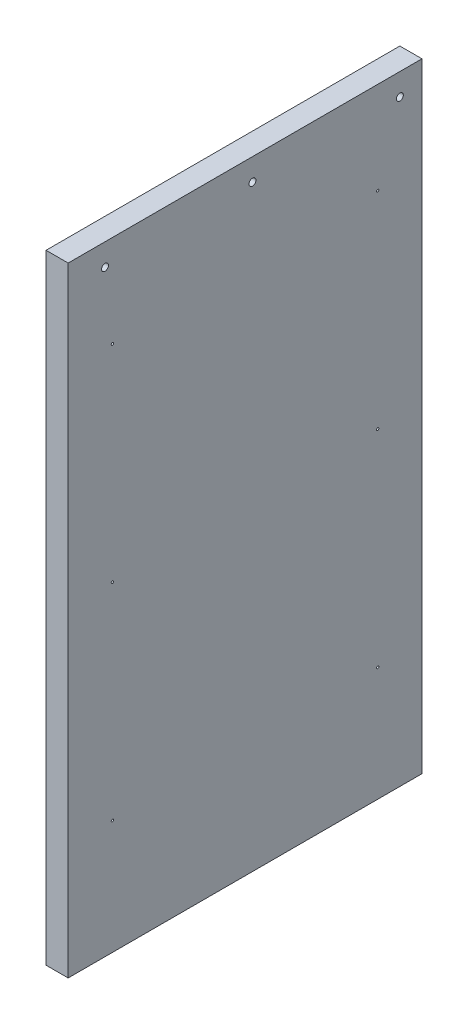
ISO-10303-21;
HEADER;
FILE_DESCRIPTION(('STEP AP214'),'2;1');
FILE_NAME('part.step','',(''),(''),'','','');
FILE_SCHEMA(('AUTOMOTIVE_DESIGN { 1 0 10303 214 1 1 1 1 }'));
ENDSEC;
DATA;
#1=APPLICATION_CONTEXT('core data for automotive mechanical design processes');
#2=APPLICATION_PROTOCOL_DEFINITION('international standard','automotive_design',2000,#1);
#3=PRODUCT_CONTEXT('',#1,'mechanical');
#4=PRODUCT('Part','Part','',(#3));
#5=PRODUCT_RELATED_PRODUCT_CATEGORY('part','',(#4));
#6=PRODUCT_DEFINITION_FORMATION('','',#4);
#7=PRODUCT_DEFINITION_CONTEXT('part definition',#1,'design');
#8=PRODUCT_DEFINITION('design','',#6,#7);
#9=PRODUCT_DEFINITION_SHAPE('','',#8);
#10=(LENGTH_UNIT() NAMED_UNIT(*) SI_UNIT(.MILLI.,.METRE.));
#11=(NAMED_UNIT(*) PLANE_ANGLE_UNIT() SI_UNIT($,.RADIAN.));
#12=(NAMED_UNIT(*) SI_UNIT($,.STERADIAN.) SOLID_ANGLE_UNIT());
#13=UNCERTAINTY_MEASURE_WITH_UNIT(LENGTH_MEASURE(1.E-05),#10,'distance_accuracy_value','');
#14=(GEOMETRIC_REPRESENTATION_CONTEXT(3) GLOBAL_UNCERTAINTY_ASSIGNED_CONTEXT((#13)) GLOBAL_UNIT_ASSIGNED_CONTEXT((#10,
#11,#12)) REPRESENTATION_CONTEXT('',''));
#15=CARTESIAN_POINT('',(0.,0.,0.));
#16=DIRECTION('',(0.,0.,1.));
#17=DIRECTION('',(1.,0.,0.));
#18=AXIS2_PLACEMENT_3D('',#15,#16,#17);
#19=CARTESIAN_POINT('',(-312.419999999999,2.66453525910038E-12,-4.44089209850063E-13));
#20=DIRECTION('',(-1.,0.,0.));
#21=DIRECTION('',(0.,0.,-1.));
#22=AXIS2_PLACEMENT_3D('',#19,#20,#21);
#23=PLANE('',#22);
#24=CARTESIAN_POINT('',(-312.42,5708.65,3032.76));
#25=DIRECTION('',(-1.,0.,0.));
#26=DIRECTION('',(0.,0.,1.));
#27=AXIS2_PLACEMENT_3D('',#24,#25,#26);
#28=CIRCLE('',#27,2.9766259999997);
#29=CARTESIAN_POINT('',(-312.42,5708.65,3035.736626));
#30=VERTEX_POINT('',#29);
#31=EDGE_CURVE('E322',#30,#30,#28,.T.);
#32=ORIENTED_EDGE('',*,*,#31,.F.);
#33=EDGE_LOOP('',(#32));
#34=FACE_BOUND('',#33,.T.);
#35=CARTESIAN_POINT('',(-312.419999999999,5708.65000000001,2905.76));
#36=DIRECTION('',(-1.,0.,0.));
#37=DIRECTION('',(0.,0.,1.));
#38=AXIS2_PLACEMENT_3D('',#35,#36,#37);
#39=CIRCLE('',#38,2.9766259999997);
#40=CARTESIAN_POINT('',(-312.419999999999,5708.65000000001,2908.736626));
#41=VERTEX_POINT('',#40);
#42=EDGE_CURVE('E332',#41,#41,#39,.T.);
#43=ORIENTED_EDGE('',*,*,#42,.F.);
#44=EDGE_LOOP('',(#43));
#45=FACE_BOUND('',#44,.T.);
#46=DIRECTION('',(0.,0.,-1.));
#47=VECTOR('',#46,1.);
#48=CARTESIAN_POINT('',(-312.42,5194.30000000001,3064.51));
#49=LINE('',#48,#47);
#50=CARTESIAN_POINT('',(-312.42,5194.30000000001,3064.51));
#51=VERTEX_POINT('',#50);
#52=CARTESIAN_POINT('',(-312.420000000001,5194.3,2759.71));
#53=VERTEX_POINT('',#52);
#54=EDGE_CURVE('E113',#51,#53,#49,.T.);
#55=ORIENTED_EDGE('',*,*,#54,.F.);
#56=DIRECTION('',(0.,-1.,0.));
#57=VECTOR('',#56,1.);
#58=CARTESIAN_POINT('',(-312.419999999999,5727.70000000001,3064.51));
#59=LINE('',#58,#57);
#60=CARTESIAN_POINT('',(-312.419999999999,5727.70000000001,3064.51));
#61=VERTEX_POINT('',#60);
#62=EDGE_CURVE('E117',#61,#51,#59,.T.);
#63=ORIENTED_EDGE('',*,*,#62,.F.);
#64=DIRECTION('',(0.,0.,1.));
#65=VECTOR('',#64,1.);
#66=CARTESIAN_POINT('',(-312.420000000001,5727.7,2759.71));
#67=LINE('',#66,#65);
#68=CARTESIAN_POINT('',(-312.420000000001,5727.7,2759.71));
#69=VERTEX_POINT('',#68);
#70=EDGE_CURVE('E112',#69,#61,#67,.T.);
#71=ORIENTED_EDGE('',*,*,#70,.F.);
#72=DIRECTION('',(0.,1.,0.));
#73=VECTOR('',#72,1.);
#74=CARTESIAN_POINT('',(-312.420000000001,5194.3,2759.71));
#75=LINE('',#74,#73);
#76=EDGE_CURVE('E107',#53,#69,#75,.T.);
#77=ORIENTED_EDGE('',*,*,#76,.F.);
#78=EDGE_LOOP('',(#55,#63,#71,#77));
#79=FACE_BOUND('',#78,.T.);
#80=CARTESIAN_POINT('',(-312.420000000001,5292.725,3026.41));
#81=DIRECTION('',(1.,0.,0.));
#82=DIRECTION('',(0.,0.,-1.));
#83=AXIS2_PLACEMENT_3D('',#80,#81,#82);
#84=CIRCLE('',#83,0.991870000000006);
#85=CARTESIAN_POINT('',(-312.420000000001,5292.725,3025.41813));
#86=VERTEX_POINT('',#85);
#87=EDGE_CURVE('E125',#86,#86,#84,.T.);
#88=ORIENTED_EDGE('',*,*,#87,.T.);
#89=EDGE_LOOP('',(#88));
#90=FACE_BOUND('',#89,.T.);
#91=CARTESIAN_POINT('',(-312.419999999999,5292.72500000001,2797.81));
#92=DIRECTION('',(1.,0.,0.));
#93=DIRECTION('',(0.,0.,-1.));
#94=AXIS2_PLACEMENT_3D('',#91,#92,#93);
#95=CIRCLE('',#94,0.991870000000006);
#96=CARTESIAN_POINT('',(-312.419999999999,5292.72500000001,2796.81813));
#97=VERTEX_POINT('',#96);
#98=EDGE_CURVE('E129',#97,#97,#95,.T.);
#99=ORIENTED_EDGE('',*,*,#98,.T.);
#100=EDGE_LOOP('',(#99));
#101=FACE_BOUND('',#100,.T.);
#102=CARTESIAN_POINT('',(-312.42,5470.52500000001,3026.41));
#103=DIRECTION('',(1.,0.,0.));
#104=DIRECTION('',(0.,0.,-1.));
#105=AXIS2_PLACEMENT_3D('',#102,#103,#104);
#106=CIRCLE('',#105,0.991870000000006);
#107=CARTESIAN_POINT('',(-312.42,5470.52500000001,3025.41813));
#108=VERTEX_POINT('',#107);
#109=EDGE_CURVE('E132',#108,#108,#106,.T.);
#110=ORIENTED_EDGE('',*,*,#109,.T.);
#111=EDGE_LOOP('',(#110));
#112=FACE_BOUND('',#111,.T.);
#113=CARTESIAN_POINT('',(-312.419999999998,5470.52500000001,2797.81));
#114=DIRECTION('',(1.,0.,0.));
#115=DIRECTION('',(0.,0.,-1.));
#116=AXIS2_PLACEMENT_3D('',#113,#114,#115);
#117=CIRCLE('',#116,0.991870000000006);
#118=CARTESIAN_POINT('',(-312.419999999998,5470.52500000001,2796.81813));
#119=VERTEX_POINT('',#118);
#120=EDGE_CURVE('E136',#119,#119,#117,.T.);
#121=ORIENTED_EDGE('',*,*,#120,.T.);
#122=EDGE_LOOP('',(#121));
#123=FACE_BOUND('',#122,.T.);
#124=CARTESIAN_POINT('',(-312.419999999999,5648.32500000001,2797.81));
#125=DIRECTION('',(1.,0.,0.));
#126=DIRECTION('',(0.,0.,-1.));
#127=AXIS2_PLACEMENT_3D('',#124,#125,#126);
#128=CIRCLE('',#127,0.991870000000006);
#129=CARTESIAN_POINT('',(-312.419999999999,5648.32500000001,2796.81813));
#130=VERTEX_POINT('',#129);
#131=EDGE_CURVE('E140',#130,#130,#128,.T.);
#132=ORIENTED_EDGE('',*,*,#131,.T.);
#133=EDGE_LOOP('',(#132));
#134=FACE_BOUND('',#133,.T.);
#135=CARTESIAN_POINT('',(-312.42,5648.325,3026.41));
#136=DIRECTION('',(1.,0.,0.));
#137=DIRECTION('',(0.,0.,-1.));
#138=AXIS2_PLACEMENT_3D('',#135,#136,#137);
#139=CIRCLE('',#138,0.991870000000006);
#140=CARTESIAN_POINT('',(-312.42,5648.325,3025.41813));
#141=VERTEX_POINT('',#140);
#142=EDGE_CURVE('E142',#141,#141,#139,.T.);
#143=ORIENTED_EDGE('',*,*,#142,.T.);
#144=EDGE_LOOP('',(#143));
#145=FACE_BOUND('',#144,.T.);
#146=CARTESIAN_POINT('',(-312.419999999999,5708.65000000001,2778.76));
#147=DIRECTION('',(-1.,0.,0.));
#148=DIRECTION('',(0.,0.,1.));
#149=AXIS2_PLACEMENT_3D('',#146,#147,#148);
#150=CIRCLE('',#149,2.9766259999997);
#151=CARTESIAN_POINT('',(-312.419999999999,5708.65000000001,2781.736626));
#152=VERTEX_POINT('',#151);
#153=EDGE_CURVE('E152',#152,#152,#150,.T.);
#154=ORIENTED_EDGE('',*,*,#153,.F.);
#155=EDGE_LOOP('',(#154));
#156=FACE_BOUND('',#155,.T.);
#157=ADVANCED_FACE('F49',(#34,#45,#79,#90,#101,#112,#123,#134,#145,#156),#23,.T.);
#158=CARTESIAN_POINT('',(-292.1,5727.70000000001,3064.51));
#159=DIRECTION('',(0.,0.,1.));
#160=DIRECTION('',(-1.,0.,0.));
#161=AXIS2_PLACEMENT_3D('',#158,#159,#160);
#162=PLANE('',#161);
#163=DIRECTION('',(-1.,0.,0.));
#164=VECTOR('',#163,1.);
#165=CARTESIAN_POINT('',(-292.1,5727.70000000001,3064.51));
#166=LINE('',#165,#164);
#167=CARTESIAN_POINT('',(-293.369999999999,5727.70000000001,3064.51));
#168=VERTEX_POINT('',#167);
#169=EDGE_CURVE('E58',#168,#61,#166,.T.);
#170=ORIENTED_EDGE('',*,*,#169,.T.);
#171=ORIENTED_EDGE('',*,*,#62,.T.);
#172=DIRECTION('',(-1.,0.,0.));
#173=VECTOR('',#172,1.);
#174=CARTESIAN_POINT('',(-292.099999999999,5194.30000000001,3064.51));
#175=LINE('',#174,#173);
#176=CARTESIAN_POINT('',(-293.369999999998,5194.30000000001,3064.51));
#177=VERTEX_POINT('',#176);
#178=EDGE_CURVE('E74',#51,#177,#175,.F.);
#179=ORIENTED_EDGE('',*,*,#178,.T.);
#180=DIRECTION('',(0.,1.,0.));
#181=VECTOR('',#180,1.);
#182=CARTESIAN_POINT('',(-293.369999999998,5194.30000000001,3064.51));
#183=LINE('',#182,#181);
#184=EDGE_CURVE('E165',#177,#168,#183,.T.);
#185=ORIENTED_EDGE('',*,*,#184,.T.);
#186=EDGE_LOOP('',(#170,#171,#179,#185));
#187=FACE_BOUND('',#186,.T.);
#188=ADVANCED_FACE('F51',(#187),#162,.T.);
#189=CARTESIAN_POINT('',(-292.099999999999,5194.30000000001,3064.51));
#190=DIRECTION('',(0.,-1.,0.));
#191=DIRECTION('',(0.,0.,-1.));
#192=AXIS2_PLACEMENT_3D('',#189,#190,#191);
#193=PLANE('',#192);
#194=ORIENTED_EDGE('',*,*,#178,.F.);
#195=ORIENTED_EDGE('',*,*,#54,.T.);
#196=DIRECTION('',(1.,0.,0.));
#197=VECTOR('',#196,1.);
#198=CARTESIAN_POINT('',(-292.100000000001,5194.3,2759.71));
#199=LINE('',#198,#197);
#200=CARTESIAN_POINT('',(-293.369999999999,5194.3,2759.71));
#201=VERTEX_POINT('',#200);
#202=EDGE_CURVE('E109',#53,#201,#199,.T.);
#203=ORIENTED_EDGE('',*,*,#202,.T.);
#204=DIRECTION('',(0.,0.,1.));
#205=VECTOR('',#204,1.);
#206=CARTESIAN_POINT('',(-293.369999999999,5194.3,2759.71));
#207=LINE('',#206,#205);
#208=EDGE_CURVE('E101',#201,#177,#207,.T.);
#209=ORIENTED_EDGE('',*,*,#208,.T.);
#210=EDGE_LOOP('',(#194,#195,#203,#209));
#211=FACE_BOUND('',#210,.T.);
#212=ADVANCED_FACE('F166',(#211),#193,.T.);
#213=CARTESIAN_POINT('',(-292.100000000001,5194.3,2759.71));
#214=DIRECTION('',(0.,0.,-1.));
#215=DIRECTION('',(1.,0.,0.));
#216=AXIS2_PLACEMENT_3D('',#213,#214,#215);
#217=PLANE('',#216);
#218=ORIENTED_EDGE('',*,*,#202,.F.);
#219=ORIENTED_EDGE('',*,*,#76,.T.);
#220=DIRECTION('',(-1.,0.,0.));
#221=VECTOR('',#220,1.);
#222=CARTESIAN_POINT('',(-292.1,5727.70000000001,2759.71));
#223=LINE('',#222,#221);
#224=CARTESIAN_POINT('',(-293.370000000001,5727.70000000001,2759.71));
#225=VERTEX_POINT('',#224);
#226=EDGE_CURVE('E13',#69,#225,#223,.F.);
#227=ORIENTED_EDGE('',*,*,#226,.T.);
#228=DIRECTION('',(0.,-1.,0.));
#229=VECTOR('',#228,1.);
#230=CARTESIAN_POINT('',(-293.370000000001,5727.70000000001,2759.71));
#231=LINE('',#230,#229);
#232=EDGE_CURVE('E96',#225,#201,#231,.T.);
#233=ORIENTED_EDGE('',*,*,#232,.T.);
#234=EDGE_LOOP('',(#218,#219,#227,#233));
#235=FACE_BOUND('',#234,.T.);
#236=ADVANCED_FACE('F105',(#235),#217,.T.);
#237=CARTESIAN_POINT('',(-292.1,5727.70000000001,2759.71));
#238=DIRECTION('',(0.,1.,0.));
#239=DIRECTION('',(0.,0.,1.));
#240=AXIS2_PLACEMENT_3D('',#237,#238,#239);
#241=PLANE('',#240);
#242=ORIENTED_EDGE('',*,*,#226,.F.);
#243=ORIENTED_EDGE('',*,*,#70,.T.);
#244=ORIENTED_EDGE('',*,*,#169,.F.);
#245=DIRECTION('',(0.,0.,-1.));
#246=VECTOR('',#245,1.);
#247=CARTESIAN_POINT('',(-293.369999999999,5727.70000000001,3064.51));
#248=LINE('',#247,#246);
#249=EDGE_CURVE('E66',#168,#225,#248,.T.);
#250=ORIENTED_EDGE('',*,*,#249,.T.);
#251=EDGE_LOOP('',(#242,#243,#244,#250));
#252=FACE_BOUND('',#251,.T.);
#253=ADVANCED_FACE('F93',(#252),#241,.T.);
#254=CARTESIAN_POINT('',(-293.370000000001,0.,-4.44089209850063E-13));
#255=DIRECTION('',(1.,0.,0.));
#256=DIRECTION('',(0.,-1.,0.));
#257=AXIS2_PLACEMENT_3D('',#254,#255,#256);
#258=PLANE('',#257);
#259=CARTESIAN_POINT('',(-293.370000000001,5708.65000000001,3032.76));
#260=DIRECTION('',(-1.,0.,0.));
#261=DIRECTION('',(0.,0.,1.));
#262=AXIS2_PLACEMENT_3D('',#259,#260,#261);
#263=CIRCLE('',#262,2.9766259999997);
#264=CARTESIAN_POINT('',(-293.370000000001,5708.65000000001,3035.736626));
#265=VERTEX_POINT('',#264);
#266=EDGE_CURVE('E325',#265,#265,#263,.T.);
#267=ORIENTED_EDGE('',*,*,#266,.T.);
#268=EDGE_LOOP('',(#267));
#269=FACE_BOUND('',#268,.T.);
#270=CARTESIAN_POINT('',(-293.369999999999,5708.65000000001,2905.76));
#271=DIRECTION('',(-1.,0.,0.));
#272=DIRECTION('',(0.,0.,1.));
#273=AXIS2_PLACEMENT_3D('',#270,#271,#272);
#274=CIRCLE('',#273,2.9766259999997);
#275=CARTESIAN_POINT('',(-293.369999999999,5708.65000000001,2908.736626));
#276=VERTEX_POINT('',#275);
#277=EDGE_CURVE('E327',#276,#276,#274,.T.);
#278=ORIENTED_EDGE('',*,*,#277,.T.);
#279=EDGE_LOOP('',(#278));
#280=FACE_BOUND('',#279,.T.);
#281=CARTESIAN_POINT('',(-293.369999999999,5708.65000000001,2778.76));
#282=DIRECTION('',(-1.,0.,0.));
#283=DIRECTION('',(0.,0.,1.));
#284=AXIS2_PLACEMENT_3D('',#281,#282,#283);
#285=CIRCLE('',#284,2.9766259999997);
#286=CARTESIAN_POINT('',(-293.369999999999,5708.65000000001,2781.736626));
#287=VERTEX_POINT('',#286);
#288=EDGE_CURVE('E334',#287,#287,#285,.T.);
#289=ORIENTED_EDGE('',*,*,#288,.T.);
#290=EDGE_LOOP('',(#289));
#291=FACE_BOUND('',#290,.T.);
#292=CARTESIAN_POINT('',(-293.37,5648.325,3026.41));
#293=DIRECTION('',(-1.,0.,0.));
#294=DIRECTION('',(0.,-1.,0.));
#295=AXIS2_PLACEMENT_3D('',#292,#293,#294);
#296=CIRCLE('',#295,0.991870000000006);
#297=CARTESIAN_POINT('',(-293.37,5647.33313,3026.41));
#298=VERTEX_POINT('',#297);
#299=EDGE_CURVE('E53',#298,#298,#296,.T.);
#300=ORIENTED_EDGE('',*,*,#299,.T.);
#301=EDGE_LOOP('',(#300));
#302=FACE_BOUND('',#301,.T.);
#303=CARTESIAN_POINT('',(-293.369999999999,5648.32500000001,2797.81));
#304=DIRECTION('',(-1.,0.,0.));
#305=DIRECTION('',(0.,-1.,0.));
#306=AXIS2_PLACEMENT_3D('',#303,#304,#305);
#307=CIRCLE('',#306,0.991870000000006);
#308=CARTESIAN_POINT('',(-293.369999999999,5647.33313000001,2797.81));
#309=VERTEX_POINT('',#308);
#310=EDGE_CURVE('E139',#309,#309,#307,.T.);
#311=ORIENTED_EDGE('',*,*,#310,.T.);
#312=EDGE_LOOP('',(#311));
#313=FACE_BOUND('',#312,.T.);
#314=CARTESIAN_POINT('',(-293.369999999999,5470.52500000001,2797.81));
#315=DIRECTION('',(-1.,0.,0.));
#316=DIRECTION('',(0.,-1.,0.));
#317=AXIS2_PLACEMENT_3D('',#314,#315,#316);
#318=CIRCLE('',#317,0.991870000000006);
#319=CARTESIAN_POINT('',(-293.369999999999,5469.53313000001,2797.81));
#320=VERTEX_POINT('',#319);
#321=EDGE_CURVE('E137',#320,#320,#318,.T.);
#322=ORIENTED_EDGE('',*,*,#321,.T.);
#323=EDGE_LOOP('',(#322));
#324=FACE_BOUND('',#323,.T.);
#325=CARTESIAN_POINT('',(-293.37,5470.52500000001,3026.41));
#326=DIRECTION('',(-1.,0.,0.));
#327=DIRECTION('',(0.,-1.,0.));
#328=AXIS2_PLACEMENT_3D('',#325,#326,#327);
#329=CIRCLE('',#328,0.991870000000006);
#330=CARTESIAN_POINT('',(-293.37,5469.53313000001,3026.41));
#331=VERTEX_POINT('',#330);
#332=EDGE_CURVE('E133',#331,#331,#329,.T.);
#333=ORIENTED_EDGE('',*,*,#332,.T.);
#334=EDGE_LOOP('',(#333));
#335=FACE_BOUND('',#334,.T.);
#336=CARTESIAN_POINT('',(-293.369999999999,5292.72500000001,2797.81));
#337=DIRECTION('',(-1.,0.,0.));
#338=DIRECTION('',(0.,-1.,0.));
#339=AXIS2_PLACEMENT_3D('',#336,#337,#338);
#340=CIRCLE('',#339,0.991870000000006);
#341=CARTESIAN_POINT('',(-293.369999999999,5291.73313000001,2797.81));
#342=VERTEX_POINT('',#341);
#343=EDGE_CURVE('E128',#342,#342,#340,.T.);
#344=ORIENTED_EDGE('',*,*,#343,.T.);
#345=EDGE_LOOP('',(#344));
#346=FACE_BOUND('',#345,.T.);
#347=CARTESIAN_POINT('',(-293.37,5292.725,3026.41));
#348=DIRECTION('',(-1.,0.,0.));
#349=DIRECTION('',(0.,-1.,0.));
#350=AXIS2_PLACEMENT_3D('',#347,#348,#349);
#351=CIRCLE('',#350,0.991870000000006);
#352=CARTESIAN_POINT('',(-293.37,5291.73313,3026.41));
#353=VERTEX_POINT('',#352);
#354=EDGE_CURVE('E97',#353,#353,#351,.T.);
#355=ORIENTED_EDGE('',*,*,#354,.T.);
#356=EDGE_LOOP('',(#355));
#357=FACE_BOUND('',#356,.T.);
#358=ORIENTED_EDGE('',*,*,#249,.F.);
#359=ORIENTED_EDGE('',*,*,#184,.F.);
#360=ORIENTED_EDGE('',*,*,#208,.F.);
#361=ORIENTED_EDGE('',*,*,#232,.F.);
#362=EDGE_LOOP('',(#358,#359,#360,#361));
#363=FACE_BOUND('',#362,.T.);
#364=ADVANCED_FACE('F100',(#269,#280,#291,#302,#313,#324,#335,#346,#357,#363),#258,.T.);
#365=CARTESIAN_POINT('',(-325.120000000001,5292.725,3026.41));
#366=DIRECTION('',(-1.,0.,0.));
#367=DIRECTION('',(0.,0.,-1.));
#368=AXIS2_PLACEMENT_3D('',#365,#366,#367);
#369=CYLINDRICAL_SURFACE('',#368,0.991870000000006);
#370=ORIENTED_EDGE('',*,*,#354,.F.);
#371=EDGE_LOOP('',(#370));
#372=FACE_BOUND('',#371,.T.);
#373=ORIENTED_EDGE('',*,*,#87,.F.);
#374=EDGE_LOOP('',(#373));
#375=FACE_BOUND('',#374,.T.);
#376=ADVANCED_FACE('F199',(#372,#375),#369,.F.);
#377=CARTESIAN_POINT('',(-325.119999999999,5292.72500000001,2797.81));
#378=DIRECTION('',(-1.,0.,0.));
#379=DIRECTION('',(0.,0.,-1.));
#380=AXIS2_PLACEMENT_3D('',#377,#378,#379);
#381=CYLINDRICAL_SURFACE('',#380,0.991870000000006);
#382=ORIENTED_EDGE('',*,*,#343,.F.);
#383=EDGE_LOOP('',(#382));
#384=FACE_BOUND('',#383,.T.);
#385=ORIENTED_EDGE('',*,*,#98,.F.);
#386=EDGE_LOOP('',(#385));
#387=FACE_BOUND('',#386,.T.);
#388=ADVANCED_FACE('F206',(#384,#387),#381,.F.);
#389=CARTESIAN_POINT('',(-325.12,5470.52500000001,3026.41));
#390=DIRECTION('',(-1.,0.,0.));
#391=DIRECTION('',(0.,0.,-1.));
#392=AXIS2_PLACEMENT_3D('',#389,#390,#391);
#393=CYLINDRICAL_SURFACE('',#392,0.991870000000006);
#394=ORIENTED_EDGE('',*,*,#109,.F.);
#395=EDGE_LOOP('',(#394));
#396=FACE_BOUND('',#395,.T.);
#397=ORIENTED_EDGE('',*,*,#332,.F.);
#398=EDGE_LOOP('',(#397));
#399=FACE_BOUND('',#398,.T.);
#400=ADVANCED_FACE('F213',(#396,#399),#393,.F.);
#401=CARTESIAN_POINT('',(-325.119999999998,5470.52500000001,2797.81));
#402=DIRECTION('',(-1.,0.,0.));
#403=DIRECTION('',(0.,0.,-1.));
#404=AXIS2_PLACEMENT_3D('',#401,#402,#403);
#405=CYLINDRICAL_SURFACE('',#404,0.991870000000006);
#406=ORIENTED_EDGE('',*,*,#120,.F.);
#407=EDGE_LOOP('',(#406));
#408=FACE_BOUND('',#407,.T.);
#409=ORIENTED_EDGE('',*,*,#321,.F.);
#410=EDGE_LOOP('',(#409));
#411=FACE_BOUND('',#410,.T.);
#412=ADVANCED_FACE('F221',(#408,#411),#405,.F.);
#413=CARTESIAN_POINT('',(-325.119999999999,5648.32500000001,2797.81));
#414=DIRECTION('',(-1.,0.,0.));
#415=DIRECTION('',(0.,0.,-1.));
#416=AXIS2_PLACEMENT_3D('',#413,#414,#415);
#417=CYLINDRICAL_SURFACE('',#416,0.991870000000006);
#418=ORIENTED_EDGE('',*,*,#310,.F.);
#419=EDGE_LOOP('',(#418));
#420=FACE_BOUND('',#419,.T.);
#421=ORIENTED_EDGE('',*,*,#131,.F.);
#422=EDGE_LOOP('',(#421));
#423=FACE_BOUND('',#422,.T.);
#424=ADVANCED_FACE('F229',(#420,#423),#417,.F.);
#425=CARTESIAN_POINT('',(-325.12,5648.325,3026.41));
#426=DIRECTION('',(-1.,0.,0.));
#427=DIRECTION('',(0.,0.,-1.));
#428=AXIS2_PLACEMENT_3D('',#425,#426,#427);
#429=CYLINDRICAL_SURFACE('',#428,0.991870000000006);
#430=ORIENTED_EDGE('',*,*,#142,.F.);
#431=EDGE_LOOP('',(#430));
#432=FACE_BOUND('',#431,.T.);
#433=ORIENTED_EDGE('',*,*,#299,.F.);
#434=EDGE_LOOP('',(#433));
#435=FACE_BOUND('',#434,.T.);
#436=ADVANCED_FACE('F237',(#432,#435),#429,.F.);
#437=CARTESIAN_POINT('',(-293.369999999999,5708.65000000001,2778.76));
#438=DIRECTION('',(1.,0.,0.));
#439=DIRECTION('',(0.,0.,1.));
#440=AXIS2_PLACEMENT_3D('',#437,#438,#439);
#441=CYLINDRICAL_SURFACE('',#440,2.9766259999997);
#442=ORIENTED_EDGE('',*,*,#153,.T.);
#443=EDGE_LOOP('',(#442));
#444=FACE_BOUND('',#443,.T.);
#445=ORIENTED_EDGE('',*,*,#288,.F.);
#446=EDGE_LOOP('',(#445));
#447=FACE_BOUND('',#446,.T.);
#448=ADVANCED_FACE('F245',(#444,#447),#441,.F.);
#449=CARTESIAN_POINT('',(-293.369999999999,5708.65000000001,2905.76));
#450=DIRECTION('',(1.,0.,0.));
#451=DIRECTION('',(0.,0.,1.));
#452=AXIS2_PLACEMENT_3D('',#449,#450,#451);
#453=CYLINDRICAL_SURFACE('',#452,2.9766259999997);
#454=ORIENTED_EDGE('',*,*,#42,.T.);
#455=EDGE_LOOP('',(#454));
#456=FACE_BOUND('',#455,.T.);
#457=ORIENTED_EDGE('',*,*,#277,.F.);
#458=EDGE_LOOP('',(#457));
#459=FACE_BOUND('',#458,.T.);
#460=ADVANCED_FACE('F253',(#456,#459),#453,.F.);
#461=CARTESIAN_POINT('',(-293.370000000001,5708.65000000001,3032.76));
#462=DIRECTION('',(1.,0.,0.));
#463=DIRECTION('',(0.,0.,1.));
#464=AXIS2_PLACEMENT_3D('',#461,#462,#463);
#465=CYLINDRICAL_SURFACE('',#464,2.9766259999997);
#466=ORIENTED_EDGE('',*,*,#31,.T.);
#467=EDGE_LOOP('',(#466));
#468=FACE_BOUND('',#467,.T.);
#469=ORIENTED_EDGE('',*,*,#266,.F.);
#470=EDGE_LOOP('',(#469));
#471=FACE_BOUND('',#470,.T.);
#472=ADVANCED_FACE('F261',(#468,#471),#465,.F.);
#473=CLOSED_SHELL('',(#157,#188,#212,#236,#253,#364,#376,#388,#400,#412,#424,#436,#448,#460,#472));
#474=MANIFOLD_SOLID_BREP('B2',#473);
#475=ADVANCED_BREP_SHAPE_REPRESENTATION('',(#18,#474),#14);
#476=SHAPE_DEFINITION_REPRESENTATION(#9,#475);
ENDSEC;
END-ISO-10303-21;
